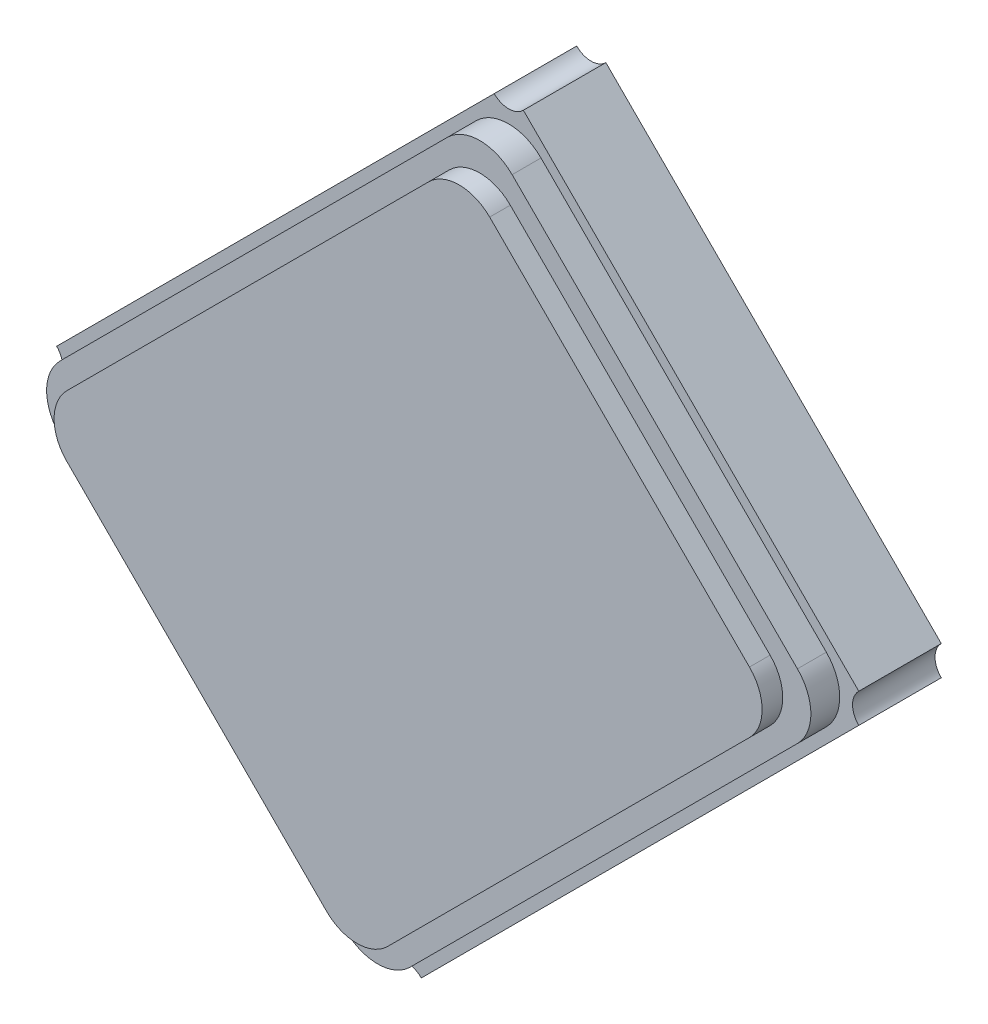
ISO-10303-21;
HEADER;
FILE_DESCRIPTION(('STEP AP214'),'2;1');
FILE_NAME('part.step','',(''),(''),'','','');
FILE_SCHEMA(('AUTOMOTIVE_DESIGN { 1 0 10303 214 1 1 1 1 }'));
ENDSEC;
DATA;
#1=APPLICATION_CONTEXT('core data for automotive mechanical design processes');
#2=APPLICATION_PROTOCOL_DEFINITION('international standard','automotive_design',2000,#1);
#3=PRODUCT_CONTEXT('',#1,'mechanical');
#4=PRODUCT('Part','Part','',(#3));
#5=PRODUCT_RELATED_PRODUCT_CATEGORY('part','',(#4));
#6=PRODUCT_DEFINITION_FORMATION('','',#4);
#7=PRODUCT_DEFINITION_CONTEXT('part definition',#1,'design');
#8=PRODUCT_DEFINITION('design','',#6,#7);
#9=PRODUCT_DEFINITION_SHAPE('','',#8);
#10=(LENGTH_UNIT() NAMED_UNIT(*) SI_UNIT(.MILLI.,.METRE.));
#11=(NAMED_UNIT(*) PLANE_ANGLE_UNIT() SI_UNIT($,.RADIAN.));
#12=(NAMED_UNIT(*) SI_UNIT($,.STERADIAN.) SOLID_ANGLE_UNIT());
#13=UNCERTAINTY_MEASURE_WITH_UNIT(LENGTH_MEASURE(1.E-05),#10,'distance_accuracy_value','');
#14=(GEOMETRIC_REPRESENTATION_CONTEXT(3) GLOBAL_UNCERTAINTY_ASSIGNED_CONTEXT((#13)) GLOBAL_UNIT_ASSIGNED_CONTEXT((#10,
#11,#12)) REPRESENTATION_CONTEXT('',''));
#15=CARTESIAN_POINT('',(0.,0.,0.));
#16=DIRECTION('',(0.,0.,1.));
#17=DIRECTION('',(1.,0.,0.));
#18=AXIS2_PLACEMENT_3D('',#15,#16,#17);
#19=CARTESIAN_POINT('',(172.078731661797,100.573960801623,112.211582908599));
#20=DIRECTION('',(0.,0.,-1.));
#21=DIRECTION('',(0.707106781186478,0.707106781186617,0.));
#22=AXIS2_PLACEMENT_3D('',#19,#20,#21);
#23=CYLINDRICAL_SURFACE('',#22,0.100006259252992);
#24=CARTESIAN_POINT('',(172.078731661797,100.573960801623,112.611582908599));
#25=DIRECTION('',(0.,0.,1.));
#26=DIRECTION('',(0.707106781186478,0.707106781186617,0.));
#27=AXIS2_PLACEMENT_3D('',#24,#25,#26);
#28=CIRCLE('',#27,0.100006259252992);
#29=CARTESIAN_POINT('',(172.150233506717,100.64388031294,112.611582908599));
#30=VERTEX_POINT('',#29);
#31=CARTESIAN_POINT('',(172.149446765876,100.644675905702,112.611582908599));
#32=VERTEX_POINT('',#31);
#33=EDGE_CURVE('E11',#30,#32,#28,.T.);
#34=ORIENTED_EDGE('',*,*,#33,.T.);
#35=DIRECTION('',(0.,0.,-1.));
#36=VECTOR('',#35,1.);
#37=CARTESIAN_POINT('',(172.149446765876,100.644675905702,112.211582908599));
#38=LINE('',#37,#36);
#39=CARTESIAN_POINT('',(172.149446765876,100.644675905702,112.211582908599));
#40=VERTEX_POINT('',#39);
#41=EDGE_CURVE('E55',#32,#40,#38,.T.);
#42=ORIENTED_EDGE('',*,*,#41,.T.);
#43=CARTESIAN_POINT('',(172.078731661797,100.573960801623,112.211582908599));
#44=DIRECTION('',(0.,0.,1.));
#45=DIRECTION('',(0.707106781186478,0.707106781186617,0.));
#46=AXIS2_PLACEMENT_3D('',#43,#44,#45);
#47=CIRCLE('',#46,0.100006259252992);
#48=CARTESIAN_POINT('',(172.150233506717,100.64388031294,112.211582908599));
#49=VERTEX_POINT('',#48);
#50=EDGE_CURVE('E397',#49,#40,#47,.T.);
#51=ORIENTED_EDGE('',*,*,#50,.F.);
#52=DIRECTION('',(0.,0.,1.));
#53=VECTOR('',#52,1.);
#54=CARTESIAN_POINT('',(172.150233506717,100.64388031294,112.211582908599));
#55=LINE('',#54,#53);
#56=EDGE_CURVE('E105',#49,#30,#55,.T.);
#57=ORIENTED_EDGE('',*,*,#56,.T.);
#58=EDGE_LOOP('',(#34,#42,#51,#57));
#59=FACE_BOUND('',#58,.T.);
#60=ADVANCED_FACE('F44',(#59),#23,.F.);
#61=CARTESIAN_POINT('',(172.32761253114,102.589659854999,112.211582908599));
#62=DIRECTION('',(0.,0.,1.));
#63=DIRECTION('',(1.,0.,0.));
#64=AXIS2_PLACEMENT_3D('',#61,#62,#63);
#65=PLANE('',#64);
#66=DIRECTION('',(0.707106781186547,0.707106781186548,0.));
#67=VECTOR('',#66,1.);
#68=CARTESIAN_POINT('',(170.382466553751,102.412834084048,112.211582908599));
#69=LINE('',#68,#67);
#70=CARTESIAN_POINT('',(170.382466553751,102.412834084048,112.211582908599));
#71=VERTEX_POINT('',#70);
#72=CARTESIAN_POINT('',(172.503786897311,104.534154427608,112.211582908599));
#73=VERTEX_POINT('',#72);
#74=EDGE_CURVE('E386',#71,#73,#69,.T.);
#75=ORIENTED_EDGE('',*,*,#74,.T.);
#76=CARTESIAN_POINT('',(172.573996898079,104.605365783077,112.211582908599));
#77=DIRECTION('',(0.,0.,1.));
#78=DIRECTION('',(0.707106781186548,0.707106781186548,0.));
#79=AXIS2_PLACEMENT_3D('',#76,#77,#78);
#80=CIRCLE('',#79,0.100002506747);
#81=CARTESIAN_POINT('',(172.645208253548,104.535155782308,112.211582908599));
#82=VERTEX_POINT('',#81);
#83=EDGE_CURVE('E120',#73,#82,#80,.T.);
#84=ORIENTED_EDGE('',*,*,#83,.T.);
#85=DIRECTION('',(0.707106781186548,-0.707106781186547,0.));
#86=VECTOR('',#85,1.);
#87=CARTESIAN_POINT('',(172.645208253548,104.535155782308,112.211582908599));
#88=LINE('',#87,#86);
#89=CARTESIAN_POINT('',(174.271553850277,102.908810185579,112.211582908599));
#90=VERTEX_POINT('',#89);
#91=EDGE_CURVE('E453',#82,#90,#88,.T.);
#92=ORIENTED_EDGE('',*,*,#91,.T.);
#93=CARTESIAN_POINT('',(174.341170441974,102.83700542104,112.211582908599));
#94=DIRECTION('',(0.,0.,1.));
#95=DIRECTION('',(0.707106781186548,0.707106781186548,0.));
#96=AXIS2_PLACEMENT_3D('',#93,#94,#95);
#97=CIRCLE('',#96,0.100011969535002);
#98=CARTESIAN_POINT('',(174.271553850277,102.7652006565,112.211582908599));
#99=VERTEX_POINT('',#98);
#100=EDGE_CURVE('E456',#90,#99,#97,.T.);
#101=ORIENTED_EDGE('',*,*,#100,.T.);
#102=DIRECTION('',(-0.707106781186547,-0.707106781186548,0.));
#103=VECTOR('',#102,1.);
#104=CARTESIAN_POINT('',(174.271553850277,102.7652006565,112.211582908599));
#105=LINE('',#104,#103);
#106=EDGE_CURVE('E407',#99,#49,#105,.T.);
#107=ORIENTED_EDGE('',*,*,#106,.T.);
#108=ORIENTED_EDGE('',*,*,#50,.T.);
#109=CARTESIAN_POINT('',(172.078731661797,100.573960801623,112.211582908599));
#110=DIRECTION('',(0.,0.,1.));
#111=DIRECTION('',(0.707106781186478,0.707106781186617,0.));
#112=AXIS2_PLACEMENT_3D('',#109,#110,#111);
#113=CIRCLE('',#112,0.100006259252992);
#114=CARTESIAN_POINT('',(172.00881215048,100.645462646544,112.211582908599));
#115=VERTEX_POINT('',#114);
#116=EDGE_CURVE('E393',#40,#115,#113,.T.);
#117=ORIENTED_EDGE('',*,*,#116,.T.);
#118=DIRECTION('',(-0.707106781186548,0.707106781186547,0.));
#119=VECTOR('',#118,1.);
#120=CARTESIAN_POINT('',(172.00881215048,100.645462646544,112.211582908599));
#121=LINE('',#120,#119);
#122=CARTESIAN_POINT('',(170.382466553751,102.271808243273,112.211582908599));
#123=VERTEX_POINT('',#122);
#124=EDGE_CURVE('E398',#115,#123,#121,.T.);
#125=ORIENTED_EDGE('',*,*,#124,.T.);
#126=CARTESIAN_POINT('',(170.311558117902,102.342321163661,112.211582908599));
#127=DIRECTION('',(0.,0.,1.));
#128=DIRECTION('',(0.707106781186548,0.707106781186548,0.));
#129=AXIS2_PLACEMENT_3D('',#126,#127,#128);
#130=CIRCLE('',#129,0.100000391079991);
#131=EDGE_CURVE('E325',#123,#71,#130,.T.);
#132=ORIENTED_EDGE('',*,*,#131,.T.);
#133=EDGE_LOOP('',(#75,#84,#92,#101,#107,#108,#117,#125,#132));
#134=FACE_BOUND('',#133,.T.);
#135=ADVANCED_FACE('F575',(#134),#65,.F.);
#136=CARTESIAN_POINT('',(174.271553850277,102.7652006565,112.211582908599));
#137=DIRECTION('',(0.707106781186548,-0.707106781186547,0.));
#138=DIRECTION('',(0.,0.,-1.));
#139=AXIS2_PLACEMENT_3D('',#136,#137,#138);
#140=PLANE('',#139);
#141=DIRECTION('',(0.,0.,1.));
#142=VECTOR('',#141,1.);
#143=CARTESIAN_POINT('',(174.271553850277,102.7652006565,112.211582908599));
#144=LINE('',#143,#142);
#145=CARTESIAN_POINT('',(174.271553850277,102.7652006565,112.611582908599));
#146=VERTEX_POINT('',#145);
#147=EDGE_CURVE('E441',#99,#146,#144,.T.);
#148=ORIENTED_EDGE('',*,*,#147,.T.);
#149=DIRECTION('',(-0.707106781186547,-0.707106781186548,0.));
#150=VECTOR('',#149,1.);
#151=CARTESIAN_POINT('',(174.271553850277,102.7652006565,112.611582908599));
#152=LINE('',#151,#150);
#153=EDGE_CURVE('E356',#146,#30,#152,.T.);
#154=ORIENTED_EDGE('',*,*,#153,.T.);
#155=ORIENTED_EDGE('',*,*,#56,.F.);
#156=ORIENTED_EDGE('',*,*,#106,.F.);
#157=EDGE_LOOP('',(#148,#154,#155,#156));
#158=FACE_BOUND('',#157,.T.);
#159=ADVANCED_FACE('F46',(#158),#140,.T.);
#160=CARTESIAN_POINT('',(174.341170441974,102.83700542104,112.211582908599));
#161=DIRECTION('',(0.,0.,-1.));
#162=DIRECTION('',(0.707106781186548,0.707106781186548,0.));
#163=AXIS2_PLACEMENT_3D('',#160,#161,#162);
#164=CYLINDRICAL_SURFACE('',#163,0.100011969535002);
#165=DIRECTION('',(0.,0.,1.));
#166=VECTOR('',#165,1.);
#167=CARTESIAN_POINT('',(174.271553850277,102.908810185579,112.211582908599));
#168=LINE('',#167,#166);
#169=CARTESIAN_POINT('',(174.271553850277,102.908810185579,112.611582908599));
#170=VERTEX_POINT('',#169);
#171=EDGE_CURVE('E352',#90,#170,#168,.T.);
#172=ORIENTED_EDGE('',*,*,#171,.T.);
#173=CARTESIAN_POINT('',(174.341170441974,102.83700542104,112.611582908599));
#174=DIRECTION('',(0.,0.,1.));
#175=DIRECTION('',(0.707106781186548,0.707106781186548,0.));
#176=AXIS2_PLACEMENT_3D('',#173,#174,#175);
#177=CIRCLE('',#176,0.100011969535002);
#178=EDGE_CURVE('E357',#170,#146,#177,.T.);
#179=ORIENTED_EDGE('',*,*,#178,.T.);
#180=ORIENTED_EDGE('',*,*,#147,.F.);
#181=ORIENTED_EDGE('',*,*,#100,.F.);
#182=EDGE_LOOP('',(#172,#179,#180,#181));
#183=FACE_BOUND('',#182,.T.);
#184=ADVANCED_FACE('F645',(#183),#164,.F.);
#185=CARTESIAN_POINT('',(172.078731661797,100.573960801623,112.211582908599));
#186=DIRECTION('',(0.,0.,-1.));
#187=DIRECTION('',(0.707106781186478,0.707106781186617,0.));
#188=AXIS2_PLACEMENT_3D('',#185,#186,#187);
#189=CYLINDRICAL_SURFACE('',#188,0.100006259252992);
#190=ORIENTED_EDGE('',*,*,#41,.F.);
#191=CARTESIAN_POINT('',(172.078731661797,100.573960801623,112.611582908599));
#192=DIRECTION('',(0.,0.,1.));
#193=DIRECTION('',(0.707106781186478,0.707106781186617,0.));
#194=AXIS2_PLACEMENT_3D('',#191,#192,#193);
#195=CIRCLE('',#194,0.100006259252992);
#196=CARTESIAN_POINT('',(172.00881215048,100.645462646544,112.611582908599));
#197=VERTEX_POINT('',#196);
#198=EDGE_CURVE('E392',#32,#197,#195,.T.);
#199=ORIENTED_EDGE('',*,*,#198,.T.);
#200=DIRECTION('',(0.,0.,1.));
#201=VECTOR('',#200,1.);
#202=CARTESIAN_POINT('',(172.00881215048,100.645462646544,112.211582908599));
#203=LINE('',#202,#201);
#204=EDGE_CURVE('E430',#115,#197,#203,.T.);
#205=ORIENTED_EDGE('',*,*,#204,.F.);
#206=ORIENTED_EDGE('',*,*,#116,.F.);
#207=EDGE_LOOP('',(#190,#199,#205,#206));
#208=FACE_BOUND('',#207,.T.);
#209=ADVANCED_FACE('F647',(#208),#189,.F.);
#210=CARTESIAN_POINT('',(172.645208253548,104.535155782308,112.211582908599));
#211=DIRECTION('',(0.707106781186547,0.707106781186548,0.));
#212=DIRECTION('',(0.,0.,-1.));
#213=AXIS2_PLACEMENT_3D('',#210,#211,#212);
#214=PLANE('',#213);
#215=DIRECTION('',(0.,0.,1.));
#216=VECTOR('',#215,1.);
#217=CARTESIAN_POINT('',(172.645208253548,104.535155782308,112.211582908599));
#218=LINE('',#217,#216);
#219=CARTESIAN_POINT('',(172.645208253548,104.535155782308,112.611582908599));
#220=VERTEX_POINT('',#219);
#221=EDGE_CURVE('E408',#82,#220,#218,.T.);
#222=ORIENTED_EDGE('',*,*,#221,.T.);
#223=DIRECTION('',(0.707106781186548,-0.707106781186547,0.));
#224=VECTOR('',#223,1.);
#225=CARTESIAN_POINT('',(172.645208253548,104.535155782308,112.611582908599));
#226=LINE('',#225,#224);
#227=EDGE_CURVE('E412',#220,#170,#226,.T.);
#228=ORIENTED_EDGE('',*,*,#227,.T.);
#229=ORIENTED_EDGE('',*,*,#171,.F.);
#230=ORIENTED_EDGE('',*,*,#91,.F.);
#231=EDGE_LOOP('',(#222,#228,#229,#230));
#232=FACE_BOUND('',#231,.T.);
#233=ADVANCED_FACE('F669',(#232),#214,.T.);
#234=CARTESIAN_POINT('',(172.00881215048,100.645462646544,112.211582908599));
#235=DIRECTION('',(-0.707106781186547,-0.707106781186548,0.));
#236=DIRECTION('',(-0.707106781186548,0.707106781186547,0.));
#237=AXIS2_PLACEMENT_3D('',#234,#235,#236);
#238=PLANE('',#237);
#239=ORIENTED_EDGE('',*,*,#204,.T.);
#240=DIRECTION('',(-0.707106781186548,0.707106781186547,0.));
#241=VECTOR('',#240,1.);
#242=CARTESIAN_POINT('',(172.00881215048,100.645462646544,112.611582908599));
#243=LINE('',#242,#241);
#244=CARTESIAN_POINT('',(170.382466553751,102.271808243273,112.611582908599));
#245=VERTEX_POINT('',#244);
#246=EDGE_CURVE('E514',#197,#245,#243,.T.);
#247=ORIENTED_EDGE('',*,*,#246,.T.);
#248=DIRECTION('',(0.,0.,1.));
#249=VECTOR('',#248,1.);
#250=CARTESIAN_POINT('',(170.382466553751,102.271808243273,112.211582908599));
#251=LINE('',#250,#249);
#252=EDGE_CURVE('E338',#123,#245,#251,.T.);
#253=ORIENTED_EDGE('',*,*,#252,.F.);
#254=ORIENTED_EDGE('',*,*,#124,.F.);
#255=EDGE_LOOP('',(#239,#247,#253,#254));
#256=FACE_BOUND('',#255,.T.);
#257=ADVANCED_FACE('F671',(#256),#238,.T.);
#258=CARTESIAN_POINT('',(172.573996898079,104.605365783077,112.211582908599));
#259=DIRECTION('',(0.,0.,-1.));
#260=DIRECTION('',(0.707106781186548,0.707106781186548,0.));
#261=AXIS2_PLACEMENT_3D('',#258,#259,#260);
#262=CYLINDRICAL_SURFACE('',#261,0.100002506747);
#263=DIRECTION('',(0.,0.,1.));
#264=VECTOR('',#263,1.);
#265=CARTESIAN_POINT('',(172.503786897311,104.534154427608,112.211582908599));
#266=LINE('',#265,#264);
#267=CARTESIAN_POINT('',(172.503786897311,104.534154427608,112.611582908599));
#268=VERTEX_POINT('',#267);
#269=EDGE_CURVE('E433',#73,#268,#266,.T.);
#270=ORIENTED_EDGE('',*,*,#269,.T.);
#271=CARTESIAN_POINT('',(172.573996898079,104.605365783077,112.611582908599));
#272=DIRECTION('',(0.,0.,1.));
#273=DIRECTION('',(0.707106781186548,0.707106781186548,0.));
#274=AXIS2_PLACEMENT_3D('',#271,#272,#273);
#275=CIRCLE('',#274,0.100002506747);
#276=EDGE_CURVE('E274',#268,#220,#275,.T.);
#277=ORIENTED_EDGE('',*,*,#276,.T.);
#278=ORIENTED_EDGE('',*,*,#221,.F.);
#279=ORIENTED_EDGE('',*,*,#83,.F.);
#280=EDGE_LOOP('',(#270,#277,#278,#279));
#281=FACE_BOUND('',#280,.T.);
#282=ADVANCED_FACE('F674',(#281),#262,.F.);
#283=CARTESIAN_POINT('',(170.311558117902,102.342321163661,112.211582908599));
#284=DIRECTION('',(0.,0.,-1.));
#285=DIRECTION('',(0.707106781186548,0.707106781186548,0.));
#286=AXIS2_PLACEMENT_3D('',#283,#284,#285);
#287=CYLINDRICAL_SURFACE('',#286,0.100000391079991);
#288=ORIENTED_EDGE('',*,*,#252,.T.);
#289=CARTESIAN_POINT('',(170.311558117902,102.342321163661,112.611582908599));
#290=DIRECTION('',(0.,0.,1.));
#291=DIRECTION('',(0.707106781186548,0.707106781186548,0.));
#292=AXIS2_PLACEMENT_3D('',#289,#290,#291);
#293=CIRCLE('',#292,0.100000391079991);
#294=CARTESIAN_POINT('',(170.382466553751,102.412834084048,112.611582908599));
#295=VERTEX_POINT('',#294);
#296=EDGE_CURVE('E341',#245,#295,#293,.T.);
#297=ORIENTED_EDGE('',*,*,#296,.T.);
#298=DIRECTION('',(0.,0.,1.));
#299=VECTOR('',#298,1.);
#300=CARTESIAN_POINT('',(170.382466553751,102.412834084048,112.211582908599));
#301=LINE('',#300,#299);
#302=EDGE_CURVE('E262',#71,#295,#301,.T.);
#303=ORIENTED_EDGE('',*,*,#302,.F.);
#304=ORIENTED_EDGE('',*,*,#131,.F.);
#305=EDGE_LOOP('',(#288,#297,#303,#304));
#306=FACE_BOUND('',#305,.T.);
#307=ADVANCED_FACE('F581',(#306),#287,.F.);
#308=CARTESIAN_POINT('',(170.382466553751,102.412834084048,112.211582908599));
#309=DIRECTION('',(-0.707106781186548,0.707106781186547,0.));
#310=DIRECTION('',(0.,0.,1.));
#311=AXIS2_PLACEMENT_3D('',#308,#309,#310);
#312=PLANE('',#311);
#313=ORIENTED_EDGE('',*,*,#302,.T.);
#314=DIRECTION('',(0.707106781186547,0.707106781186548,0.));
#315=VECTOR('',#314,1.);
#316=CARTESIAN_POINT('',(170.382466553751,102.412834084048,112.611582908599));
#317=LINE('',#316,#315);
#318=EDGE_CURVE('E485',#295,#268,#317,.T.);
#319=ORIENTED_EDGE('',*,*,#318,.T.);
#320=ORIENTED_EDGE('',*,*,#269,.F.);
#321=ORIENTED_EDGE('',*,*,#74,.F.);
#322=EDGE_LOOP('',(#313,#319,#320,#321));
#323=FACE_BOUND('',#322,.T.);
#324=ADVANCED_FACE('F580',(#323),#312,.T.);
#325=CARTESIAN_POINT('',(172.32761253114,102.589659854999,112.611582908599));
#326=DIRECTION('',(0.,0.,1.));
#327=DIRECTION('',(1.,0.,0.));
#328=AXIS2_PLACEMENT_3D('',#325,#326,#327);
#329=PLANE('',#328);
#330=ORIENTED_EDGE('',*,*,#318,.F.);
#331=ORIENTED_EDGE('',*,*,#296,.F.);
#332=ORIENTED_EDGE('',*,*,#246,.F.);
#333=ORIENTED_EDGE('',*,*,#198,.F.);
#334=ORIENTED_EDGE('',*,*,#33,.F.);
#335=ORIENTED_EDGE('',*,*,#153,.F.);
#336=ORIENTED_EDGE('',*,*,#178,.F.);
#337=ORIENTED_EDGE('',*,*,#227,.F.);
#338=ORIENTED_EDGE('',*,*,#276,.F.);
#339=EDGE_LOOP('',(#330,#331,#332,#333,#334,#335,#336,#337,#338));
#340=FACE_BOUND('',#339,.T.);
#341=CARTESIAN_POINT('',(173.957243633578,102.837150665765,112.611582908599));
#342=DIRECTION('',(0.,0.,-1.));
#343=DIRECTION('',(0.707106781186548,0.707106781186548,0.));
#344=AXIS2_PLACEMENT_3D('',#341,#342,#343);
#345=CIRCLE('',#344,0.221794149744007);
#346=CARTESIAN_POINT('',(174.114075780889,102.993982813077,112.611582908599));
#347=VERTEX_POINT('',#346);
#348=CARTESIAN_POINT('',(174.114075780889,102.680318518454,112.611582908599));
#349=VERTEX_POINT('',#348);
#350=EDGE_CURVE('E48',#347,#349,#345,.T.);
#351=ORIENTED_EDGE('',*,*,#350,.T.);
#352=DIRECTION('',(-0.707106781186547,-0.707106781186548,0.));
#353=VECTOR('',#352,1.);
#354=CARTESIAN_POINT('',(172.705611939061,101.271854676625,112.611582908599));
#355=LINE('',#354,#353);
#356=CARTESIAN_POINT('',(172.235709053834,100.801951791399,112.611582908599));
#357=VERTEX_POINT('',#356);
#358=EDGE_CURVE('E346',#349,#357,#355,.T.);
#359=ORIENTED_EDGE('',*,*,#358,.T.);
#360=CARTESIAN_POINT('',(172.078876906523,100.95878393871,112.611582908599));
#361=DIRECTION('',(0.,0.,-1.));
#362=DIRECTION('',(0.707106781186548,0.707106781186548,0.));
#363=AXIS2_PLACEMENT_3D('',#360,#361,#362);
#364=CIRCLE('',#363,0.221794149744007);
#365=CARTESIAN_POINT('',(171.922044759211,100.801951791399,112.611582908599));
#366=VERTEX_POINT('',#365);
#367=EDGE_CURVE('E342',#357,#366,#364,.T.);
#368=ORIENTED_EDGE('',*,*,#367,.T.);
#369=DIRECTION('',(-0.707106781186548,0.707106781186547,0.));
#370=VECTOR('',#369,1.);
#371=CARTESIAN_POINT('',(170.884813696181,101.839182854429,112.611582908599));
#372=LINE('',#371,#370);
#373=CARTESIAN_POINT('',(170.538652778986,102.185343771623,112.611582908599));
#374=VERTEX_POINT('',#373);
#375=EDGE_CURVE('E347',#366,#374,#372,.T.);
#376=ORIENTED_EDGE('',*,*,#375,.T.);
#377=CARTESIAN_POINT('',(170.695484926298,102.342175918935,112.611582908599));
#378=DIRECTION('',(0.,0.,-1.));
#379=DIRECTION('',(0.707106781186548,0.707106781186548,0.));
#380=AXIS2_PLACEMENT_3D('',#377,#378,#379);
#381=CIRCLE('',#380,0.221794149744007);
#382=CARTESIAN_POINT('',(170.538652778986,102.499008066246,112.611582908599));
#383=VERTEX_POINT('',#382);
#384=EDGE_CURVE('E459',#374,#383,#381,.T.);
#385=ORIENTED_EDGE('',*,*,#384,.T.);
#386=DIRECTION('',(0.707106781186547,0.707106781186548,0.));
#387=VECTOR('',#386,1.);
#388=CARTESIAN_POINT('',(171.94773902774,103.908094315,112.611582908599));
#389=LINE('',#388,#387);
#390=CARTESIAN_POINT('',(172.417019506042,104.377374793302,112.611582908599));
#391=VERTEX_POINT('',#390);
#392=EDGE_CURVE('E362',#383,#391,#389,.T.);
#393=ORIENTED_EDGE('',*,*,#392,.T.);
#394=CARTESIAN_POINT('',(172.573851653353,104.22054264599,112.611582908599));
#395=DIRECTION('',(0.,0.,-1.));
#396=DIRECTION('',(0.707106781186548,0.707106781186548,0.));
#397=AXIS2_PLACEMENT_3D('',#394,#395,#396);
#398=CIRCLE('',#397,0.221794149744007);
#399=CARTESIAN_POINT('',(172.730683800665,104.377374793302,112.611582908599));
#400=VERTEX_POINT('',#399);
#401=EDGE_CURVE('E358',#391,#400,#398,.T.);
#402=ORIENTED_EDGE('',*,*,#401,.T.);
#403=DIRECTION('',(0.707106781186548,-0.707106781186547,0.));
#404=VECTOR('',#403,1.);
#405=CARTESIAN_POINT('',(173.768540707972,103.339517885995,112.611582908599));
#406=LINE('',#405,#404);
#407=EDGE_CURVE('E351',#400,#347,#406,.T.);
#408=ORIENTED_EDGE('',*,*,#407,.T.);
#409=EDGE_LOOP('',(#351,#359,#368,#376,#385,#393,#402,#408));
#410=FACE_BOUND('',#409,.T.);
#411=ADVANCED_FACE('F584',(#340,#410),#329,.T.);
#412=CARTESIAN_POINT('',(172.417019506042,104.377374793302,112.601582908599));
#413=DIRECTION('',(0.707106781186548,-0.707106781186547,0.));
#414=DIRECTION('',(0.,0.,-1.));
#415=AXIS2_PLACEMENT_3D('',#412,#413,#414);
#416=PLANE('',#415);
#417=DIRECTION('',(0.,0.,1.));
#418=VECTOR('',#417,1.);
#419=CARTESIAN_POINT('',(170.538652778986,102.499008066246,112.601582908599));
#420=LINE('',#419,#418);
#421=CARTESIAN_POINT('',(170.538652778986,102.499008066246,112.751582908599));
#422=VERTEX_POINT('',#421);
#423=EDGE_CURVE('E330',#383,#422,#420,.T.);
#424=ORIENTED_EDGE('',*,*,#423,.T.);
#425=DIRECTION('',(-0.707106781186547,-0.707106781186548,0.));
#426=VECTOR('',#425,1.);
#427=CARTESIAN_POINT('',(172.417019506042,104.377374793302,112.751582908599));
#428=LINE('',#427,#426);
#429=CARTESIAN_POINT('',(172.417019506042,104.377374793302,112.751582908599));
#430=VERTEX_POINT('',#429);
#431=EDGE_CURVE('E337',#430,#422,#428,.T.);
#432=ORIENTED_EDGE('',*,*,#431,.F.);
#433=DIRECTION('',(0.,0.,1.));
#434=VECTOR('',#433,1.);
#435=CARTESIAN_POINT('',(172.417019506042,104.377374793302,112.601582908599));
#436=LINE('',#435,#434);
#437=EDGE_CURVE('E327',#391,#430,#436,.T.);
#438=ORIENTED_EDGE('',*,*,#437,.F.);
#439=ORIENTED_EDGE('',*,*,#392,.F.);
#440=EDGE_LOOP('',(#424,#432,#438,#439));
#441=FACE_BOUND('',#440,.T.);
#442=ADVANCED_FACE('F586',(#441),#416,.F.);
#443=CARTESIAN_POINT('',(172.573851653353,104.22054264599,112.601582908599));
#444=DIRECTION('',(0.,0.,-1.));
#445=DIRECTION('',(0.707106781186548,0.707106781186548,0.));
#446=AXIS2_PLACEMENT_3D('',#443,#444,#445);
#447=CYLINDRICAL_SURFACE('',#446,0.221794149744007);
#448=ORIENTED_EDGE('',*,*,#437,.T.);
#449=CARTESIAN_POINT('',(172.573851653353,104.22054264599,112.751582908599));
#450=DIRECTION('',(0.,0.,1.));
#451=DIRECTION('',(0.707106781186548,0.707106781186548,0.));
#452=AXIS2_PLACEMENT_3D('',#449,#450,#451);
#453=CIRCLE('',#452,0.221794149744007);
#454=CARTESIAN_POINT('',(172.730683800665,104.377374793302,112.751582908599));
#455=VERTEX_POINT('',#454);
#456=EDGE_CURVE('E332',#455,#430,#453,.T.);
#457=ORIENTED_EDGE('',*,*,#456,.F.);
#458=DIRECTION('',(0.,0.,1.));
#459=VECTOR('',#458,1.);
#460=CARTESIAN_POINT('',(172.730683800665,104.377374793302,112.601582908599));
#461=LINE('',#460,#459);
#462=EDGE_CURVE('E444',#400,#455,#461,.T.);
#463=ORIENTED_EDGE('',*,*,#462,.F.);
#464=ORIENTED_EDGE('',*,*,#401,.F.);
#465=EDGE_LOOP('',(#448,#457,#463,#464));
#466=FACE_BOUND('',#465,.T.);
#467=ADVANCED_FACE('F613',(#466),#447,.T.);
#468=CARTESIAN_POINT('',(170.695484926298,102.342175918935,112.601582908599));
#469=DIRECTION('',(0.,0.,-1.));
#470=DIRECTION('',(0.707106781186548,0.707106781186548,0.));
#471=AXIS2_PLACEMENT_3D('',#468,#469,#470);
#472=CYLINDRICAL_SURFACE('',#471,0.221794149744007);
#473=DIRECTION('',(0.,0.,1.));
#474=VECTOR('',#473,1.);
#475=CARTESIAN_POINT('',(170.538652778986,102.185343771623,112.601582908599));
#476=LINE('',#475,#474);
#477=CARTESIAN_POINT('',(170.538652778986,102.185343771623,112.751582908599));
#478=VERTEX_POINT('',#477);
#479=EDGE_CURVE('E331',#374,#478,#476,.T.);
#480=ORIENTED_EDGE('',*,*,#479,.T.);
#481=CARTESIAN_POINT('',(170.695484926298,102.342175918935,112.751582908599));
#482=DIRECTION('',(0.,0.,1.));
#483=DIRECTION('',(0.707106781186548,0.707106781186548,0.));
#484=AXIS2_PLACEMENT_3D('',#481,#482,#483);
#485=CIRCLE('',#484,0.221794149744007);
#486=EDGE_CURVE('E419',#422,#478,#485,.T.);
#487=ORIENTED_EDGE('',*,*,#486,.F.);
#488=ORIENTED_EDGE('',*,*,#423,.F.);
#489=ORIENTED_EDGE('',*,*,#384,.F.);
#490=EDGE_LOOP('',(#480,#487,#488,#489));
#491=FACE_BOUND('',#490,.T.);
#492=ADVANCED_FACE('F608',(#491),#472,.T.);
#493=CARTESIAN_POINT('',(174.114075780889,102.993982813077,112.601582908599));
#494=DIRECTION('',(-0.707106781186547,-0.707106781186548,0.));
#495=DIRECTION('',(-0.707106781186548,0.707106781186547,0.));
#496=AXIS2_PLACEMENT_3D('',#493,#494,#495);
#497=PLANE('',#496);
#498=ORIENTED_EDGE('',*,*,#462,.T.);
#499=DIRECTION('',(-0.707106781186548,0.707106781186547,0.));
#500=VECTOR('',#499,1.);
#501=CARTESIAN_POINT('',(174.114075780889,102.993982813077,112.751582908599));
#502=LINE('',#501,#500);
#503=CARTESIAN_POINT('',(174.114075780889,102.993982813077,112.751582908599));
#504=VERTEX_POINT('',#503);
#505=EDGE_CURVE('E336',#504,#455,#502,.T.);
#506=ORIENTED_EDGE('',*,*,#505,.F.);
#507=DIRECTION('',(0.,0.,1.));
#508=VECTOR('',#507,1.);
#509=CARTESIAN_POINT('',(174.114075780889,102.993982813077,112.601582908599));
#510=LINE('',#509,#508);
#511=EDGE_CURVE('E413',#347,#504,#510,.T.);
#512=ORIENTED_EDGE('',*,*,#511,.F.);
#513=ORIENTED_EDGE('',*,*,#407,.F.);
#514=EDGE_LOOP('',(#498,#506,#512,#513));
#515=FACE_BOUND('',#514,.T.);
#516=ADVANCED_FACE('F615',(#515),#497,.F.);
#517=CARTESIAN_POINT('',(170.538652778986,102.185343771623,112.601582908599));
#518=DIRECTION('',(0.707106781186547,0.707106781186548,0.));
#519=DIRECTION('',(0.,0.,-1.));
#520=AXIS2_PLACEMENT_3D('',#517,#518,#519);
#521=PLANE('',#520);
#522=DIRECTION('',(0.,0.,1.));
#523=VECTOR('',#522,1.);
#524=CARTESIAN_POINT('',(171.922044759211,100.801951791399,112.601582908599));
#525=LINE('',#524,#523);
#526=CARTESIAN_POINT('',(171.922044759211,100.801951791399,112.751582908599));
#527=VERTEX_POINT('',#526);
#528=EDGE_CURVE('E416',#366,#527,#525,.T.);
#529=ORIENTED_EDGE('',*,*,#528,.T.);
#530=DIRECTION('',(0.707106781186548,-0.707106781186547,0.));
#531=VECTOR('',#530,1.);
#532=CARTESIAN_POINT('',(170.538652778986,102.185343771623,112.751582908599));
#533=LINE('',#532,#531);
#534=EDGE_CURVE('E214',#478,#527,#533,.T.);
#535=ORIENTED_EDGE('',*,*,#534,.F.);
#536=ORIENTED_EDGE('',*,*,#479,.F.);
#537=ORIENTED_EDGE('',*,*,#375,.F.);
#538=EDGE_LOOP('',(#529,#535,#536,#537));
#539=FACE_BOUND('',#538,.T.);
#540=ADVANCED_FACE('F605',(#539),#521,.F.);
#541=CARTESIAN_POINT('',(173.957243633578,102.837150665765,112.601582908599));
#542=DIRECTION('',(0.,0.,-1.));
#543=DIRECTION('',(0.707106781186548,0.707106781186548,0.));
#544=AXIS2_PLACEMENT_3D('',#541,#542,#543);
#545=CYLINDRICAL_SURFACE('',#544,0.221794149744007);
#546=ORIENTED_EDGE('',*,*,#511,.T.);
#547=CARTESIAN_POINT('',(173.957243633578,102.837150665765,112.751582908599));
#548=DIRECTION('',(0.,0.,1.));
#549=DIRECTION('',(0.707106781186548,0.707106781186548,0.));
#550=AXIS2_PLACEMENT_3D('',#547,#548,#549);
#551=CIRCLE('',#550,0.221794149744007);
#552=CARTESIAN_POINT('',(174.114075780889,102.680318518454,112.751582908599));
#553=VERTEX_POINT('',#552);
#554=EDGE_CURVE('E227',#553,#504,#551,.T.);
#555=ORIENTED_EDGE('',*,*,#554,.F.);
#556=DIRECTION('',(0.,0.,1.));
#557=VECTOR('',#556,1.);
#558=CARTESIAN_POINT('',(174.114075780889,102.680318518454,112.601582908599));
#559=LINE('',#558,#557);
#560=EDGE_CURVE('E366',#349,#553,#559,.T.);
#561=ORIENTED_EDGE('',*,*,#560,.F.);
#562=ORIENTED_EDGE('',*,*,#350,.F.);
#563=EDGE_LOOP('',(#546,#555,#561,#562));
#564=FACE_BOUND('',#563,.T.);
#565=ADVANCED_FACE('F592',(#564),#545,.T.);
#566=CARTESIAN_POINT('',(172.078876906523,100.95878393871,112.601582908599));
#567=DIRECTION('',(0.,0.,-1.));
#568=DIRECTION('',(0.707106781186548,0.707106781186548,0.));
#569=AXIS2_PLACEMENT_3D('',#566,#567,#568);
#570=CYLINDRICAL_SURFACE('',#569,0.221794149744007);
#571=DIRECTION('',(0.,0.,1.));
#572=VECTOR('',#571,1.);
#573=CARTESIAN_POINT('',(172.235709053834,100.801951791399,112.601582908599));
#574=LINE('',#573,#572);
#575=CARTESIAN_POINT('',(172.235709053834,100.801951791399,112.751582908599));
#576=VERTEX_POINT('',#575);
#577=EDGE_CURVE('E369',#357,#576,#574,.T.);
#578=ORIENTED_EDGE('',*,*,#577,.T.);
#579=CARTESIAN_POINT('',(172.078876906523,100.95878393871,112.751582908599));
#580=DIRECTION('',(0.,0.,1.));
#581=DIRECTION('',(0.707106781186548,0.707106781186548,0.));
#582=AXIS2_PLACEMENT_3D('',#579,#580,#581);
#583=CIRCLE('',#582,0.221794149744007);
#584=EDGE_CURVE('E420',#527,#576,#583,.T.);
#585=ORIENTED_EDGE('',*,*,#584,.F.);
#586=ORIENTED_EDGE('',*,*,#528,.F.);
#587=ORIENTED_EDGE('',*,*,#367,.F.);
#588=EDGE_LOOP('',(#578,#585,#586,#587));
#589=FACE_BOUND('',#588,.T.);
#590=ADVANCED_FACE('F601',(#589),#570,.T.);
#591=CARTESIAN_POINT('',(172.235709053834,100.801951791399,112.601582908599));
#592=DIRECTION('',(-0.707106781186548,0.707106781186547,0.));
#593=DIRECTION('',(0.,0.,1.));
#594=AXIS2_PLACEMENT_3D('',#591,#592,#593);
#595=PLANE('',#594);
#596=ORIENTED_EDGE('',*,*,#560,.T.);
#597=DIRECTION('',(0.707106781186547,0.707106781186548,0.));
#598=VECTOR('',#597,1.);
#599=CARTESIAN_POINT('',(172.235709053834,100.801951791399,112.751582908599));
#600=LINE('',#599,#598);
#601=EDGE_CURVE('E370',#576,#553,#600,.T.);
#602=ORIENTED_EDGE('',*,*,#601,.F.);
#603=ORIENTED_EDGE('',*,*,#577,.F.);
#604=ORIENTED_EDGE('',*,*,#358,.F.);
#605=EDGE_LOOP('',(#596,#602,#603,#604));
#606=FACE_BOUND('',#605,.T.);
#607=ADVANCED_FACE('F595',(#606),#595,.F.);
#608=CARTESIAN_POINT('',(172.326364279938,102.58966329235,112.751582908599));
#609=DIRECTION('',(0.,0.,1.));
#610=DIRECTION('',(1.,0.,0.));
#611=AXIS2_PLACEMENT_3D('',#608,#609,#610);
#612=PLANE('',#611);
#613=ORIENTED_EDGE('',*,*,#601,.T.);
#614=ORIENTED_EDGE('',*,*,#554,.T.);
#615=ORIENTED_EDGE('',*,*,#505,.T.);
#616=ORIENTED_EDGE('',*,*,#456,.T.);
#617=ORIENTED_EDGE('',*,*,#431,.T.);
#618=ORIENTED_EDGE('',*,*,#486,.T.);
#619=ORIENTED_EDGE('',*,*,#534,.T.);
#620=ORIENTED_EDGE('',*,*,#584,.T.);
#621=EDGE_LOOP('',(#613,#614,#615,#616,#617,#618,#619,#620));
#622=FACE_BOUND('',#621,.T.);
#623=DIRECTION('',(0.707106781186547,0.707106781186548,0.));
#624=VECTOR('',#623,1.);
#625=CARTESIAN_POINT('',(172.226879460448,100.934543554249,112.751582908599));
#626=LINE('',#625,#624);
#627=CARTESIAN_POINT('',(172.226879460448,100.934543554249,112.751582908599));
#628=VERTEX_POINT('',#627);
#629=CARTESIAN_POINT('',(173.981484018039,102.689148111841,112.751582908599));
#630=VERTEX_POINT('',#629);
#631=EDGE_CURVE('E310',#628,#630,#626,.T.);
#632=ORIENTED_EDGE('',*,*,#631,.F.);
#633=CARTESIAN_POINT('',(172.078876906523,101.082546108174,112.751582908599));
#634=DIRECTION('',(0.,0.,1.));
#635=DIRECTION('',(0.707106781186548,0.707106781186548,0.));
#636=AXIS2_PLACEMENT_3D('',#633,#634,#635);
#637=CIRCLE('',#636,0.209307219025998);
#638=CARTESIAN_POINT('',(171.930874352598,100.934543554249,112.751582908599));
#639=VERTEX_POINT('',#638);
#640=EDGE_CURVE('E421',#639,#628,#637,.T.);
#641=ORIENTED_EDGE('',*,*,#640,.F.);
#642=DIRECTION('',(0.707106781186548,-0.707106781186547,0.));
#643=VECTOR('',#642,1.);
#644=CARTESIAN_POINT('',(170.671244541837,102.19417336501,112.751582908599));
#645=LINE('',#644,#643);
#646=CARTESIAN_POINT('',(170.671244541837,102.19417336501,112.751582908599));
#647=VERTEX_POINT('',#646);
#648=EDGE_CURVE('E371',#647,#639,#645,.T.);
#649=ORIENTED_EDGE('',*,*,#648,.F.);
#650=CARTESIAN_POINT('',(170.819247095762,102.342175918935,112.751582908599));
#651=DIRECTION('',(0.,0.,1.));
#652=DIRECTION('',(0.707106781186548,0.707106781186548,0.));
#653=AXIS2_PLACEMENT_3D('',#650,#651,#652);
#654=CIRCLE('',#653,0.209307219025998);
#655=CARTESIAN_POINT('',(170.671244541837,102.490178472859,112.751582908599));
#656=VERTEX_POINT('',#655);
#657=EDGE_CURVE('E482',#656,#647,#654,.T.);
#658=ORIENTED_EDGE('',*,*,#657,.F.);
#659=DIRECTION('',(-0.707106781186547,-0.707106781186548,0.));
#660=VECTOR('',#659,1.);
#661=CARTESIAN_POINT('',(172.425849099428,104.244783030451,112.751582908599));
#662=LINE('',#661,#660);
#663=CARTESIAN_POINT('',(172.425849099428,104.244783030451,112.751582908599));
#664=VERTEX_POINT('',#663);
#665=EDGE_CURVE('E376',#664,#656,#662,.T.);
#666=ORIENTED_EDGE('',*,*,#665,.F.);
#667=CARTESIAN_POINT('',(172.573851653353,104.096780476527,112.751582908599));
#668=DIRECTION('',(0.,0.,1.));
#669=DIRECTION('',(0.707106781186548,0.707106781186548,0.));
#670=AXIS2_PLACEMENT_3D('',#667,#668,#669);
#671=CIRCLE('',#670,0.209307219025998);
#672=CARTESIAN_POINT('',(172.721854207278,104.244783030451,112.751582908599));
#673=VERTEX_POINT('',#672);
#674=EDGE_CURVE('E437',#673,#664,#671,.T.);
#675=ORIENTED_EDGE('',*,*,#674,.F.);
#676=DIRECTION('',(-0.707106781186548,0.707106781186547,0.));
#677=VECTOR('',#676,1.);
#678=CARTESIAN_POINT('',(173.981484018039,102.98515321969,112.751582908599));
#679=LINE('',#678,#677);
#680=CARTESIAN_POINT('',(173.981484018039,102.98515321969,112.751582908599));
#681=VERTEX_POINT('',#680);
#682=EDGE_CURVE('E381',#681,#673,#679,.T.);
#683=ORIENTED_EDGE('',*,*,#682,.F.);
#684=CARTESIAN_POINT('',(173.833481464114,102.837150665765,112.751582908599));
#685=DIRECTION('',(0.,0.,1.));
#686=DIRECTION('',(0.707106781186548,0.707106781186548,0.));
#687=AXIS2_PLACEMENT_3D('',#684,#685,#686);
#688=CIRCLE('',#687,0.209307219025998);
#689=EDGE_CURVE('E501',#630,#681,#688,.T.);
#690=ORIENTED_EDGE('',*,*,#689,.F.);
#691=EDGE_LOOP('',(#632,#641,#649,#658,#666,#675,#683,#690));
#692=FACE_BOUND('',#691,.T.);
#693=ADVANCED_FACE('F596',(#622,#692),#612,.T.);
#694=CARTESIAN_POINT('',(172.078876906523,101.082546108174,112.751582908599));
#695=DIRECTION('',(0.,0.,-1.));
#696=DIRECTION('',(0.707106781186548,0.707106781186548,0.));
#697=AXIS2_PLACEMENT_3D('',#694,#695,#696);
#698=CYLINDRICAL_SURFACE('',#697,0.209307219025998);
#699=ORIENTED_EDGE('',*,*,#640,.T.);
#700=DIRECTION('',(0.,0.,1.));
#701=VECTOR('',#700,1.);
#702=CARTESIAN_POINT('',(172.226879460448,100.934543554249,112.751582908599));
#703=LINE('',#702,#701);
#704=CARTESIAN_POINT('',(172.226879460448,100.934543554249,112.851582908599));
#705=VERTEX_POINT('',#704);
#706=EDGE_CURVE('E374',#628,#705,#703,.T.);
#707=ORIENTED_EDGE('',*,*,#706,.T.);
#708=CARTESIAN_POINT('',(172.078876906523,101.082546108174,112.851582908599));
#709=DIRECTION('',(0.,0.,1.));
#710=DIRECTION('',(0.707106781186548,0.707106781186548,0.));
#711=AXIS2_PLACEMENT_3D('',#708,#709,#710);
#712=CIRCLE('',#711,0.209307219025998);
#713=CARTESIAN_POINT('',(171.930874352598,100.934543554249,112.851582908599));
#714=VERTEX_POINT('',#713);
#715=EDGE_CURVE('E316',#714,#705,#712,.T.);
#716=ORIENTED_EDGE('',*,*,#715,.F.);
#717=DIRECTION('',(0.,0.,1.));
#718=VECTOR('',#717,1.);
#719=CARTESIAN_POINT('',(171.930874352598,100.934543554249,112.751582908599));
#720=LINE('',#719,#718);
#721=EDGE_CURVE('E375',#639,#714,#720,.T.);
#722=ORIENTED_EDGE('',*,*,#721,.F.);
#723=EDGE_LOOP('',(#699,#707,#716,#722));
#724=FACE_BOUND('',#723,.T.);
#725=ADVANCED_FACE('F654',(#724),#698,.T.);
#726=CARTESIAN_POINT('',(170.671244541837,102.19417336501,112.751582908599));
#727=DIRECTION('',(0.707106781186547,0.707106781186548,0.));
#728=DIRECTION('',(0.,0.,-1.));
#729=AXIS2_PLACEMENT_3D('',#726,#727,#728);
#730=PLANE('',#729);
#731=ORIENTED_EDGE('',*,*,#648,.T.);
#732=ORIENTED_EDGE('',*,*,#721,.T.);
#733=DIRECTION('',(0.707106781186548,-0.707106781186547,0.));
#734=VECTOR('',#733,1.);
#735=CARTESIAN_POINT('',(170.671244541837,102.19417336501,112.851582908599));
#736=LINE('',#735,#734);
#737=CARTESIAN_POINT('',(170.671244541837,102.19417336501,112.851582908599));
#738=VERTEX_POINT('',#737);
#739=EDGE_CURVE('E364',#738,#714,#736,.T.);
#740=ORIENTED_EDGE('',*,*,#739,.F.);
#741=DIRECTION('',(0.,0.,1.));
#742=VECTOR('',#741,1.);
#743=CARTESIAN_POINT('',(170.671244541837,102.19417336501,112.751582908599));
#744=LINE('',#743,#742);
#745=EDGE_CURVE('E379',#647,#738,#744,.T.);
#746=ORIENTED_EDGE('',*,*,#745,.F.);
#747=EDGE_LOOP('',(#731,#732,#740,#746));
#748=FACE_BOUND('',#747,.T.);
#749=ADVANCED_FACE('F643',(#748),#730,.F.);
#750=CARTESIAN_POINT('',(170.819247095762,102.342175918935,112.751582908599));
#751=DIRECTION('',(0.,0.,-1.));
#752=DIRECTION('',(0.707106781186548,0.707106781186548,0.));
#753=AXIS2_PLACEMENT_3D('',#750,#751,#752);
#754=CYLINDRICAL_SURFACE('',#753,0.209307219025998);
#755=ORIENTED_EDGE('',*,*,#657,.T.);
#756=ORIENTED_EDGE('',*,*,#745,.T.);
#757=CARTESIAN_POINT('',(170.819247095762,102.342175918935,112.851582908599));
#758=DIRECTION('',(0.,0.,1.));
#759=DIRECTION('',(0.707106781186548,0.707106781186548,0.));
#760=AXIS2_PLACEMENT_3D('',#757,#758,#759);
#761=CIRCLE('',#760,0.209307219025998);
#762=CARTESIAN_POINT('',(170.671244541837,102.490178472859,112.851582908599));
#763=VERTEX_POINT('',#762);
#764=EDGE_CURVE('E404',#763,#738,#761,.T.);
#765=ORIENTED_EDGE('',*,*,#764,.F.);
#766=DIRECTION('',(0.,0.,1.));
#767=VECTOR('',#766,1.);
#768=CARTESIAN_POINT('',(170.671244541837,102.490178472859,112.751582908599));
#769=LINE('',#768,#767);
#770=EDGE_CURVE('E380',#656,#763,#769,.T.);
#771=ORIENTED_EDGE('',*,*,#770,.F.);
#772=EDGE_LOOP('',(#755,#756,#765,#771));
#773=FACE_BOUND('',#772,.T.);
#774=ADVANCED_FACE('F828',(#773),#754,.T.);
#775=CARTESIAN_POINT('',(172.425849099428,104.244783030451,112.751582908599));
#776=DIRECTION('',(0.707106781186548,-0.707106781186547,0.));
#777=DIRECTION('',(0.,0.,-1.));
#778=AXIS2_PLACEMENT_3D('',#775,#776,#777);
#779=PLANE('',#778);
#780=ORIENTED_EDGE('',*,*,#665,.T.);
#781=ORIENTED_EDGE('',*,*,#770,.T.);
#782=DIRECTION('',(-0.707106781186547,-0.707106781186548,0.));
#783=VECTOR('',#782,1.);
#784=CARTESIAN_POINT('',(172.425849099428,104.244783030451,112.851582908599));
#785=LINE('',#784,#783);
#786=CARTESIAN_POINT('',(172.425849099428,104.244783030451,112.851582908599));
#787=VERTEX_POINT('',#786);
#788=EDGE_CURVE('E452',#787,#763,#785,.T.);
#789=ORIENTED_EDGE('',*,*,#788,.F.);
#790=DIRECTION('',(0.,0.,1.));
#791=VECTOR('',#790,1.);
#792=CARTESIAN_POINT('',(172.425849099428,104.244783030451,112.751582908599));
#793=LINE('',#792,#791);
#794=EDGE_CURVE('E384',#664,#787,#793,.T.);
#795=ORIENTED_EDGE('',*,*,#794,.F.);
#796=EDGE_LOOP('',(#780,#781,#789,#795));
#797=FACE_BOUND('',#796,.T.);
#798=ADVANCED_FACE('F837',(#797),#779,.F.);
#799=CARTESIAN_POINT('',(172.573851653353,104.096780476527,112.751582908599));
#800=DIRECTION('',(0.,0.,-1.));
#801=DIRECTION('',(0.707106781186548,0.707106781186548,0.));
#802=AXIS2_PLACEMENT_3D('',#799,#800,#801);
#803=CYLINDRICAL_SURFACE('',#802,0.209307219025998);
#804=ORIENTED_EDGE('',*,*,#674,.T.);
#805=ORIENTED_EDGE('',*,*,#794,.T.);
#806=CARTESIAN_POINT('',(172.573851653353,104.096780476527,112.851582908599));
#807=DIRECTION('',(0.,0.,1.));
#808=DIRECTION('',(0.707106781186548,0.707106781186548,0.));
#809=AXIS2_PLACEMENT_3D('',#806,#807,#808);
#810=CIRCLE('',#809,0.209307219025998);
#811=CARTESIAN_POINT('',(172.721854207278,104.244783030451,112.851582908599));
#812=VERTEX_POINT('',#811);
#813=EDGE_CURVE('E448',#812,#787,#810,.T.);
#814=ORIENTED_EDGE('',*,*,#813,.F.);
#815=DIRECTION('',(0.,0.,1.));
#816=VECTOR('',#815,1.);
#817=CARTESIAN_POINT('',(172.721854207278,104.244783030451,112.751582908599));
#818=LINE('',#817,#816);
#819=EDGE_CURVE('E385',#673,#812,#818,.T.);
#820=ORIENTED_EDGE('',*,*,#819,.F.);
#821=EDGE_LOOP('',(#804,#805,#814,#820));
#822=FACE_BOUND('',#821,.T.);
#823=ADVANCED_FACE('F849',(#822),#803,.T.);
#824=CARTESIAN_POINT('',(173.981484018039,102.98515321969,112.751582908599));
#825=DIRECTION('',(-0.707106781186547,-0.707106781186548,0.));
#826=DIRECTION('',(-0.707106781186548,0.707106781186547,0.));
#827=AXIS2_PLACEMENT_3D('',#824,#825,#826);
#828=PLANE('',#827);
#829=ORIENTED_EDGE('',*,*,#682,.T.);
#830=ORIENTED_EDGE('',*,*,#819,.T.);
#831=DIRECTION('',(-0.707106781186548,0.707106781186547,0.));
#832=VECTOR('',#831,1.);
#833=CARTESIAN_POINT('',(173.981484018039,102.98515321969,112.851582908599));
#834=LINE('',#833,#832);
#835=CARTESIAN_POINT('',(173.981484018039,102.98515321969,112.851582908599));
#836=VERTEX_POINT('',#835);
#837=EDGE_CURVE('E303',#836,#812,#834,.T.);
#838=ORIENTED_EDGE('',*,*,#837,.F.);
#839=DIRECTION('',(0.,0.,1.));
#840=VECTOR('',#839,1.);
#841=CARTESIAN_POINT('',(173.981484018039,102.98515321969,112.751582908599));
#842=LINE('',#841,#840);
#843=EDGE_CURVE('E297',#681,#836,#842,.T.);
#844=ORIENTED_EDGE('',*,*,#843,.F.);
#845=EDGE_LOOP('',(#829,#830,#838,#844));
#846=FACE_BOUND('',#845,.T.);
#847=ADVANCED_FACE('F495',(#846),#828,.F.);
#848=CARTESIAN_POINT('',(173.833481464114,102.837150665765,112.751582908599));
#849=DIRECTION('',(0.,0.,-1.));
#850=DIRECTION('',(0.707106781186548,0.707106781186548,0.));
#851=AXIS2_PLACEMENT_3D('',#848,#849,#850);
#852=CYLINDRICAL_SURFACE('',#851,0.209307219025998);
#853=ORIENTED_EDGE('',*,*,#689,.T.);
#854=ORIENTED_EDGE('',*,*,#843,.T.);
#855=CARTESIAN_POINT('',(173.833481464114,102.837150665765,112.851582908599));
#856=DIRECTION('',(0.,0.,1.));
#857=DIRECTION('',(0.707106781186548,0.707106781186548,0.));
#858=AXIS2_PLACEMENT_3D('',#855,#856,#857);
#859=CIRCLE('',#858,0.209307219025998);
#860=CARTESIAN_POINT('',(173.981484018039,102.689148111841,112.851582908599));
#861=VERTEX_POINT('',#860);
#862=EDGE_CURVE('E292',#861,#836,#859,.T.);
#863=ORIENTED_EDGE('',*,*,#862,.F.);
#864=DIRECTION('',(0.,0.,1.));
#865=VECTOR('',#864,1.);
#866=CARTESIAN_POINT('',(173.981484018039,102.689148111841,112.751582908599));
#867=LINE('',#866,#865);
#868=EDGE_CURVE('E295',#630,#861,#867,.T.);
#869=ORIENTED_EDGE('',*,*,#868,.F.);
#870=EDGE_LOOP('',(#853,#854,#863,#869));
#871=FACE_BOUND('',#870,.T.);
#872=ADVANCED_FACE('F294',(#871),#852,.T.);
#873=CARTESIAN_POINT('',(172.226879460448,100.934543554249,112.751582908599));
#874=DIRECTION('',(-0.707106781186548,0.707106781186547,0.));
#875=DIRECTION('',(0.,0.,1.));
#876=AXIS2_PLACEMENT_3D('',#873,#874,#875);
#877=PLANE('',#876);
#878=ORIENTED_EDGE('',*,*,#631,.T.);
#879=ORIENTED_EDGE('',*,*,#868,.T.);
#880=DIRECTION('',(0.707106781186547,0.707106781186548,0.));
#881=VECTOR('',#880,1.);
#882=CARTESIAN_POINT('',(172.226879460448,100.934543554249,112.851582908599));
#883=LINE('',#882,#881);
#884=EDGE_CURVE('E302',#705,#861,#883,.T.);
#885=ORIENTED_EDGE('',*,*,#884,.F.);
#886=ORIENTED_EDGE('',*,*,#706,.F.);
#887=EDGE_LOOP('',(#878,#879,#885,#886));
#888=FACE_BOUND('',#887,.T.);
#889=ADVANCED_FACE('F307',(#888),#877,.F.);
#890=CARTESIAN_POINT('',(172.326364279938,102.58966329235,112.851582908599));
#891=DIRECTION('',(0.,0.,1.));
#892=DIRECTION('',(1.,0.,0.));
#893=AXIS2_PLACEMENT_3D('',#890,#891,#892);
#894=PLANE('',#893);
#895=ORIENTED_EDGE('',*,*,#884,.T.);
#896=ORIENTED_EDGE('',*,*,#862,.T.);
#897=ORIENTED_EDGE('',*,*,#837,.T.);
#898=ORIENTED_EDGE('',*,*,#813,.T.);
#899=ORIENTED_EDGE('',*,*,#788,.T.);
#900=ORIENTED_EDGE('',*,*,#764,.T.);
#901=ORIENTED_EDGE('',*,*,#739,.T.);
#902=ORIENTED_EDGE('',*,*,#715,.T.);
#903=EDGE_LOOP('',(#895,#896,#897,#898,#899,#900,#901,#902));
#904=FACE_BOUND('',#903,.T.);
#905=ADVANCED_FACE('F314',(#904),#894,.T.);
#906=CLOSED_SHELL('',(#60,#135,#159,#184,#209,#233,#257,#282,#307,#324,#411,#442,#467,#492,#516,
#540,#565,#590,#607,#693,#725,#749,#774,#798,#823,#847,#872,#889,#905));
#907=MANIFOLD_SOLID_BREP('B2',#906);
#908=ADVANCED_BREP_SHAPE_REPRESENTATION('',(#18,#907),#14);
#909=SHAPE_DEFINITION_REPRESENTATION(#9,#908);
ENDSEC;
END-ISO-10303-21;
